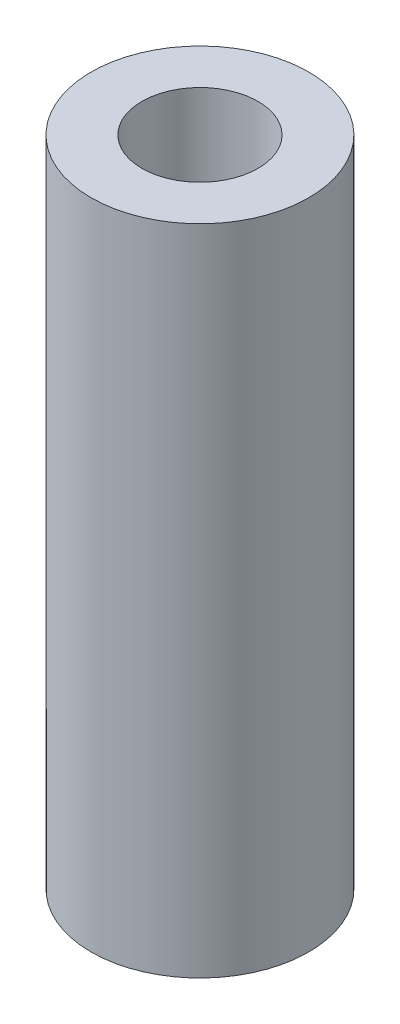
ISO-10303-21;
HEADER;
FILE_DESCRIPTION(('STEP AP214'),'2;1');
FILE_NAME('part.step','',(''),(''),'','','');
FILE_SCHEMA(('AUTOMOTIVE_DESIGN { 1 0 10303 214 1 1 1 1 }'));
ENDSEC;
DATA;
#1=APPLICATION_CONTEXT('core data for automotive mechanical design processes');
#2=APPLICATION_PROTOCOL_DEFINITION('international standard','automotive_design',2000,#1);
#3=PRODUCT_CONTEXT('',#1,'mechanical');
#4=PRODUCT('Part','Part','',(#3));
#5=PRODUCT_RELATED_PRODUCT_CATEGORY('part','',(#4));
#6=PRODUCT_DEFINITION_FORMATION('','',#4);
#7=PRODUCT_DEFINITION_CONTEXT('part definition',#1,'design');
#8=PRODUCT_DEFINITION('design','',#6,#7);
#9=PRODUCT_DEFINITION_SHAPE('','',#8);
#10=(LENGTH_UNIT() NAMED_UNIT(*) SI_UNIT(.MILLI.,.METRE.));
#11=(NAMED_UNIT(*) PLANE_ANGLE_UNIT() SI_UNIT($,.RADIAN.));
#12=(NAMED_UNIT(*) SI_UNIT($,.STERADIAN.) SOLID_ANGLE_UNIT());
#13=UNCERTAINTY_MEASURE_WITH_UNIT(LENGTH_MEASURE(1.E-05),#10,'distance_accuracy_value','');
#14=(GEOMETRIC_REPRESENTATION_CONTEXT(3) GLOBAL_UNCERTAINTY_ASSIGNED_CONTEXT((#13)) GLOBAL_UNIT_ASSIGNED_CONTEXT((#10,
#11,#12)) REPRESENTATION_CONTEXT('',''));
#15=CARTESIAN_POINT('',(0.,0.,0.));
#16=DIRECTION('',(0.,0.,1.));
#17=DIRECTION('',(1.,0.,0.));
#18=AXIS2_PLACEMENT_3D('',#15,#16,#17);
#19=CARTESIAN_POINT('',(0.,18.,0.));
#20=DIRECTION('',(0.,1.,0.));
#21=DIRECTION('',(0.,0.,1.00000000000002));
#22=AXIS2_PLACEMENT_3D('',#19,#20,#21);
#23=PLANE('',#22);
#24=CARTESIAN_POINT('',(0.,18.,0.));
#25=DIRECTION('',(0.,1.,0.));
#26=DIRECTION('',(0.,0.,1.00000000000002));
#27=AXIS2_PLACEMENT_3D('',#24,#25,#26);
#28=CIRCLE('',#27,3.);
#29=CARTESIAN_POINT('',(0.,18.,3.));
#30=VERTEX_POINT('',#29);
#31=EDGE_CURVE('E10',#30,#30,#28,.T.);
#32=ORIENTED_EDGE('',*,*,#31,.T.);
#33=EDGE_LOOP('',(#32));
#34=FACE_BOUND('',#33,.T.);
#35=CARTESIAN_POINT('',(0.,18.,0.));
#36=DIRECTION('',(0.,1.,0.));
#37=DIRECTION('',(0.,0.,1.00000000000002));
#38=AXIS2_PLACEMENT_3D('',#35,#36,#37);
#39=CIRCLE('',#38,1.6);
#40=CARTESIAN_POINT('',(0.,18.,1.59999999999998));
#41=VERTEX_POINT('',#40);
#42=EDGE_CURVE('E41',#41,#41,#39,.T.);
#43=ORIENTED_EDGE('',*,*,#42,.F.);
#44=EDGE_LOOP('',(#43));
#45=FACE_BOUND('',#44,.T.);
#46=ADVANCED_FACE('F30',(#34,#45),#23,.T.);
#47=CARTESIAN_POINT('',(0.,0.,0.));
#48=DIRECTION('',(0.,1.,0.));
#49=DIRECTION('',(0.,0.,1.00000000000002));
#50=AXIS2_PLACEMENT_3D('',#47,#48,#49);
#51=PLANE('',#50);
#52=CARTESIAN_POINT('',(0.,0.,0.));
#53=DIRECTION('',(0.,1.,0.));
#54=DIRECTION('',(0.,0.,1.00000000000002));
#55=AXIS2_PLACEMENT_3D('',#52,#53,#54);
#56=CIRCLE('',#55,3.);
#57=CARTESIAN_POINT('',(0.,0.,3.00000000000005));
#58=VERTEX_POINT('',#57);
#59=EDGE_CURVE('E34',#58,#58,#56,.T.);
#60=ORIENTED_EDGE('',*,*,#59,.F.);
#61=EDGE_LOOP('',(#60));
#62=FACE_BOUND('',#61,.T.);
#63=CARTESIAN_POINT('',(0.,0.,0.));
#64=DIRECTION('',(0.,1.,0.));
#65=DIRECTION('',(0.,0.,1.00000000000002));
#66=AXIS2_PLACEMENT_3D('',#63,#64,#65);
#67=CIRCLE('',#66,1.6);
#68=CARTESIAN_POINT('',(0.,0.,1.60000000000002));
#69=VERTEX_POINT('',#68);
#70=EDGE_CURVE('E43',#69,#69,#67,.T.);
#71=ORIENTED_EDGE('',*,*,#70,.T.);
#72=EDGE_LOOP('',(#71));
#73=FACE_BOUND('',#72,.T.);
#74=ADVANCED_FACE('F53',(#62,#73),#51,.F.);
#75=CARTESIAN_POINT('',(0.,18.,0.));
#76=DIRECTION('',(0.,-1.,0.));
#77=DIRECTION('',(0.,0.,-1.00000000000002));
#78=AXIS2_PLACEMENT_3D('',#75,#76,#77);
#79=CYLINDRICAL_SURFACE('',#78,3.);
#80=ORIENTED_EDGE('',*,*,#31,.F.);
#81=EDGE_LOOP('',(#80));
#82=FACE_BOUND('',#81,.T.);
#83=ORIENTED_EDGE('',*,*,#59,.T.);
#84=EDGE_LOOP('',(#83));
#85=FACE_BOUND('',#84,.T.);
#86=ADVANCED_FACE('F32',(#82,#85),#79,.T.);
#87=CARTESIAN_POINT('',(0.,18.,0.));
#88=DIRECTION('',(0.,-1.,0.));
#89=DIRECTION('',(0.,0.,-1.00000000000002));
#90=AXIS2_PLACEMENT_3D('',#87,#88,#89);
#91=CYLINDRICAL_SURFACE('',#90,1.6);
#92=ORIENTED_EDGE('',*,*,#42,.T.);
#93=EDGE_LOOP('',(#92));
#94=FACE_BOUND('',#93,.T.);
#95=ORIENTED_EDGE('',*,*,#70,.F.);
#96=EDGE_LOOP('',(#95));
#97=FACE_BOUND('',#96,.T.);
#98=ADVANCED_FACE('F49',(#94,#97),#91,.F.);
#99=CLOSED_SHELL('',(#46,#74,#86,#98));
#100=MANIFOLD_SOLID_BREP('B2',#99);
#101=ADVANCED_BREP_SHAPE_REPRESENTATION('',(#18,#100),#14);
#102=SHAPE_DEFINITION_REPRESENTATION(#9,#101);
ENDSEC;
END-ISO-10303-21;
